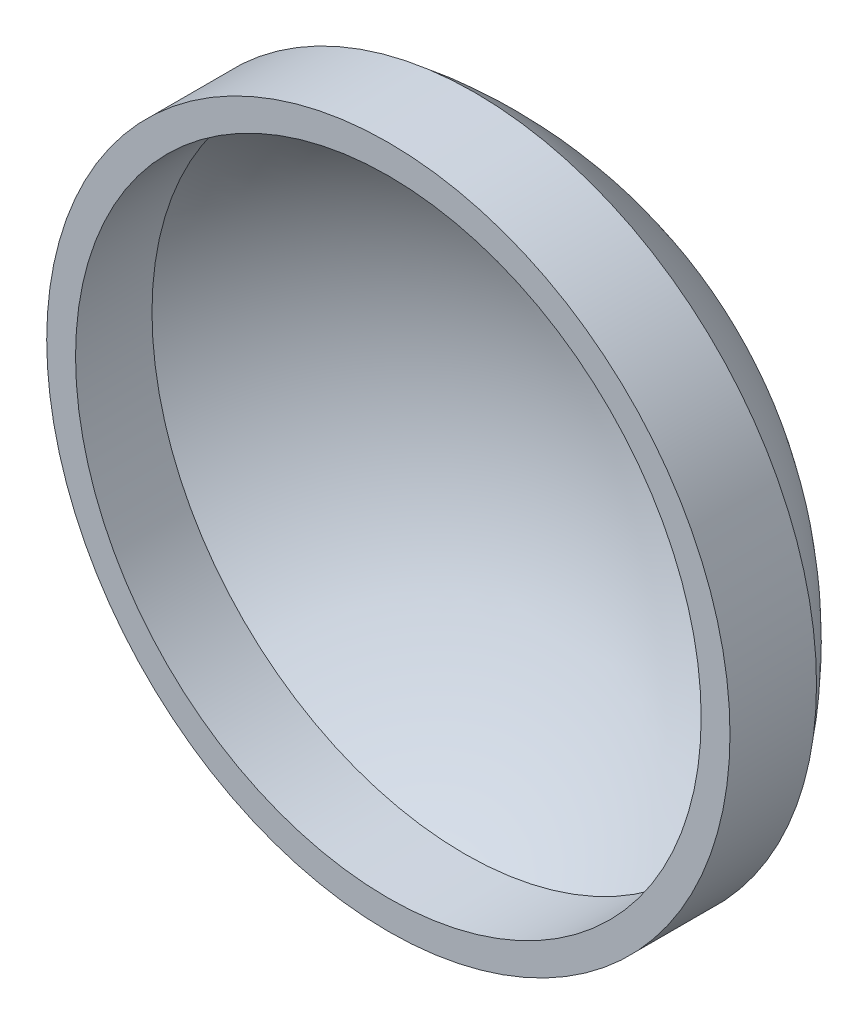
ISO-10303-21;
HEADER;
FILE_DESCRIPTION(('STEP AP214'),'2;1');
FILE_NAME('part.step','',(''),(''),'','','');
FILE_SCHEMA(('AUTOMOTIVE_DESIGN { 1 0 10303 214 1 1 1 1 }'));
ENDSEC;
DATA;
#1=APPLICATION_CONTEXT('core data for automotive mechanical design processes');
#2=APPLICATION_PROTOCOL_DEFINITION('international standard','automotive_design',2000,#1);
#3=PRODUCT_CONTEXT('',#1,'mechanical');
#4=PRODUCT('Part','Part','',(#3));
#5=PRODUCT_RELATED_PRODUCT_CATEGORY('part','',(#4));
#6=PRODUCT_DEFINITION_FORMATION('','',#4);
#7=PRODUCT_DEFINITION_CONTEXT('part definition',#1,'design');
#8=PRODUCT_DEFINITION('design','',#6,#7);
#9=PRODUCT_DEFINITION_SHAPE('','',#8);
#10=(LENGTH_UNIT() NAMED_UNIT(*) SI_UNIT(.MILLI.,.METRE.));
#11=(NAMED_UNIT(*) PLANE_ANGLE_UNIT() SI_UNIT($,.RADIAN.));
#12=(NAMED_UNIT(*) SI_UNIT($,.STERADIAN.) SOLID_ANGLE_UNIT());
#13=UNCERTAINTY_MEASURE_WITH_UNIT(LENGTH_MEASURE(1.E-05),#10,'distance_accuracy_value','');
#14=(GEOMETRIC_REPRESENTATION_CONTEXT(3) GLOBAL_UNCERTAINTY_ASSIGNED_CONTEXT((#13)) GLOBAL_UNIT_ASSIGNED_CONTEXT((#10,
#11,#12)) REPRESENTATION_CONTEXT('',''));
#15=CARTESIAN_POINT('',(0.,0.,0.));
#16=DIRECTION('',(0.,0.,1.));
#17=DIRECTION('',(1.,0.,0.));
#18=AXIS2_PLACEMENT_3D('',#15,#16,#17);
#19=CARTESIAN_POINT('',(-2.37657116208823E-13,0.,4.85722573273506E-13));
#20=DIRECTION('',(0.,0.,1.));
#21=DIRECTION('',(1.,0.,0.));
#22=AXIS2_PLACEMENT_3D('',#19,#20,#21);
#23=SPHERICAL_SURFACE('',#22,38.1000000000005);
#24=CARTESIAN_POINT('',(0.,0.,-23.368));
#25=DIRECTION('',(0.,0.,1.));
#26=DIRECTION('',(1.,0.,0.));
#27=AXIS2_PLACEMENT_3D('',#24,#25,#26);
#28=CIRCLE('',#27,30.0923009422676);
#29=CARTESIAN_POINT('',(30.0923009422676,0.,-23.368));
#30=VERTEX_POINT('',#29);
#31=EDGE_CURVE('E10',#30,#30,#28,.T.);
#32=ORIENTED_EDGE('',*,*,#31,.F.);
#33=EDGE_LOOP('',(#32));
#34=FACE_BOUND('',#33,.T.);
#35=ADVANCED_FACE('F39',(#34),#23,.T.);
#36=CARTESIAN_POINT('',(0.,0.,0.));
#37=DIRECTION('',(0.,0.,1.));
#38=DIRECTION('',(1.,0.,0.));
#39=AXIS2_PLACEMENT_3D('',#36,#37,#38);
#40=CYLINDRICAL_SURFACE('',#39,30.0923009422676);
#41=ORIENTED_EDGE('',*,*,#31,.T.);
#42=EDGE_LOOP('',(#41));
#43=FACE_BOUND('',#42,.T.);
#44=CARTESIAN_POINT('',(0.,0.,-15.748));
#45=DIRECTION('',(0.,0.,1.));
#46=DIRECTION('',(1.,0.,0.));
#47=AXIS2_PLACEMENT_3D('',#44,#45,#46);
#48=CIRCLE('',#47,30.0923009422676);
#49=CARTESIAN_POINT('',(30.0923009422676,0.,-15.748));
#50=VERTEX_POINT('',#49);
#51=EDGE_CURVE('E45',#50,#50,#48,.T.);
#52=ORIENTED_EDGE('',*,*,#51,.F.);
#53=EDGE_LOOP('',(#52));
#54=FACE_BOUND('',#53,.T.);
#55=ADVANCED_FACE('F64',(#43,#54),#40,.T.);
#56=CARTESIAN_POINT('',(0.,0.,-15.748));
#57=DIRECTION('',(0.,0.,1.));
#58=DIRECTION('',(1.,0.,0.));
#59=AXIS2_PLACEMENT_3D('',#56,#57,#58);
#60=PLANE('',#59);
#61=CARTESIAN_POINT('',(0.,0.,-15.748));
#62=DIRECTION('',(0.,0.,1.));
#63=DIRECTION('',(1.,0.,0.));
#64=AXIS2_PLACEMENT_3D('',#61,#62,#63);
#65=CIRCLE('',#64,27.5523009422676);
#66=CARTESIAN_POINT('',(27.5523009422676,0.,-15.748));
#67=VERTEX_POINT('',#66);
#68=EDGE_CURVE('E53',#67,#67,#65,.T.);
#69=ORIENTED_EDGE('',*,*,#68,.F.);
#70=EDGE_LOOP('',(#69));
#71=FACE_BOUND('',#70,.T.);
#72=ORIENTED_EDGE('',*,*,#51,.T.);
#73=EDGE_LOOP('',(#72));
#74=FACE_BOUND('',#73,.T.);
#75=ADVANCED_FACE('F61',(#71,#74),#60,.T.);
#76=CARTESIAN_POINT('',(-2.37657116208823E-13,0.,4.85722573273506E-13));
#77=DIRECTION('',(0.,0.,1.));
#78=DIRECTION('',(1.,0.,0.));
#79=AXIS2_PLACEMENT_3D('',#76,#77,#78);
#80=SPHERICAL_SURFACE('',#79,35.5600000000005);
#81=CARTESIAN_POINT('',(0.,0.,-22.480754275307));
#82=DIRECTION('',(0.,0.,1.));
#83=DIRECTION('',(1.,0.,0.));
#84=AXIS2_PLACEMENT_3D('',#81,#82,#83);
#85=CIRCLE('',#84,27.5523009422676);
#86=CARTESIAN_POINT('',(27.5523009422676,0.,-22.480754275307));
#87=VERTEX_POINT('',#86);
#88=EDGE_CURVE('E49',#87,#87,#85,.T.);
#89=ORIENTED_EDGE('',*,*,#88,.T.);
#90=EDGE_LOOP('',(#89));
#91=FACE_BOUND('',#90,.T.);
#92=ADVANCED_FACE('F63',(#91),#80,.F.);
#93=CARTESIAN_POINT('',(0.,0.,0.));
#94=DIRECTION('',(0.,0.,1.));
#95=DIRECTION('',(1.,0.,0.));
#96=AXIS2_PLACEMENT_3D('',#93,#94,#95);
#97=CYLINDRICAL_SURFACE('',#96,27.5523009422676);
#98=ORIENTED_EDGE('',*,*,#88,.F.);
#99=EDGE_LOOP('',(#98));
#100=FACE_BOUND('',#99,.T.);
#101=ORIENTED_EDGE('',*,*,#68,.T.);
#102=EDGE_LOOP('',(#101));
#103=FACE_BOUND('',#102,.T.);
#104=ADVANCED_FACE('F59',(#100,#103),#97,.F.);
#105=CLOSED_SHELL('',(#35,#55,#75,#92,#104));
#106=MANIFOLD_SOLID_BREP('B2',#105);
#107=ADVANCED_BREP_SHAPE_REPRESENTATION('',(#18,#106),#14);
#108=SHAPE_DEFINITION_REPRESENTATION(#9,#107);
ENDSEC;
END-ISO-10303-21;
